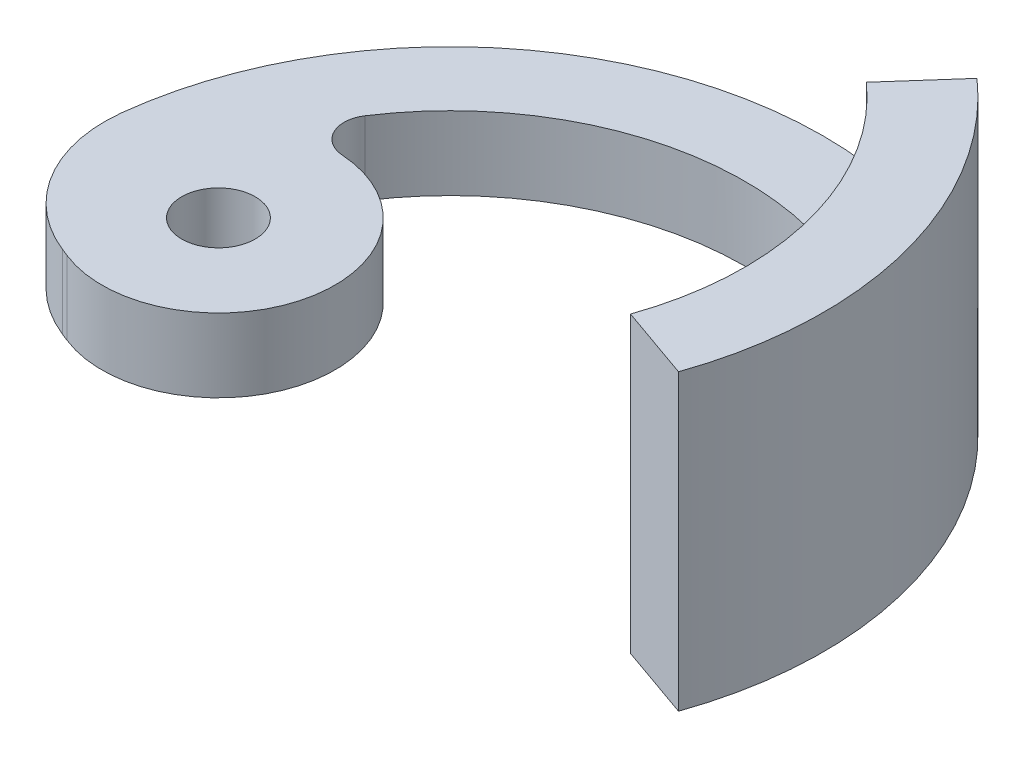
ISO-10303-21;
HEADER;
FILE_DESCRIPTION(('STEP AP214'),'2;1');
FILE_NAME('part.step','',(''),(''),'','','');
FILE_SCHEMA(('AUTOMOTIVE_DESIGN { 1 0 10303 214 1 1 1 1 }'));
ENDSEC;
DATA;
#1=APPLICATION_CONTEXT('core data for automotive mechanical design processes');
#2=APPLICATION_PROTOCOL_DEFINITION('international standard','automotive_design',2000,#1);
#3=PRODUCT_CONTEXT('',#1,'mechanical');
#4=PRODUCT('Part','Part','',(#3));
#5=PRODUCT_RELATED_PRODUCT_CATEGORY('part','',(#4));
#6=PRODUCT_DEFINITION_FORMATION('','',#4);
#7=PRODUCT_DEFINITION_CONTEXT('part definition',#1,'design');
#8=PRODUCT_DEFINITION('design','',#6,#7);
#9=PRODUCT_DEFINITION_SHAPE('','',#8);
#10=(LENGTH_UNIT() NAMED_UNIT(*) SI_UNIT(.MILLI.,.METRE.));
#11=(NAMED_UNIT(*) PLANE_ANGLE_UNIT() SI_UNIT($,.RADIAN.));
#12=(NAMED_UNIT(*) SI_UNIT($,.STERADIAN.) SOLID_ANGLE_UNIT());
#13=UNCERTAINTY_MEASURE_WITH_UNIT(LENGTH_MEASURE(1.E-05),#10,'distance_accuracy_value','');
#14=(GEOMETRIC_REPRESENTATION_CONTEXT(3) GLOBAL_UNCERTAINTY_ASSIGNED_CONTEXT((#13)) GLOBAL_UNIT_ASSIGNED_CONTEXT((#10,
#11,#12)) REPRESENTATION_CONTEXT('',''));
#15=CARTESIAN_POINT('',(0.,0.,0.));
#16=DIRECTION('',(0.,0.,1.));
#17=DIRECTION('',(1.,0.,0.));
#18=AXIS2_PLACEMENT_3D('',#15,#16,#17);
#19=CARTESIAN_POINT('',(0.,5.,0.));
#20=DIRECTION('',(0.,1.,0.));
#21=DIRECTION('',(0.,0.,1.));
#22=AXIS2_PLACEMENT_3D('',#19,#20,#21);
#23=PLANE('',#22);
#24=CARTESIAN_POINT('',(0.,5.,0.));
#25=DIRECTION('',(0.,-1.,0.));
#26=DIRECTION('',(0.,0.,1.));
#27=AXIS2_PLACEMENT_3D('',#24,#25,#26);
#28=CIRCLE('',#27,20.066);
#29=CARTESIAN_POINT('',(-16.780436798581,5.,-11.002785867626));
#30=VERTEX_POINT('',#29);
#31=CARTESIAN_POINT('',(10.0357032359987,5.,-17.3761047579417));
#32=VERTEX_POINT('',#31);
#33=EDGE_CURVE('E151',#30,#32,#28,.T.);
#34=ORIENTED_EDGE('',*,*,#33,.T.);
#35=DIRECTION('',(-0.662716862978516,0.,0.748870055165724));
#36=VECTOR('',#35,1.);
#37=CARTESIAN_POINT('',(13.8375280989914,5.,-21.6721668531235));
#38=LINE('',#37,#36);
#39=CARTESIAN_POINT('',(13.6274879511749,5.,-21.4348214860908));
#40=VERTEX_POINT('',#39);
#41=EDGE_CURVE('E60',#32,#40,#38,.F.);
#42=ORIENTED_EDGE('',*,*,#41,.T.);
#43=CARTESIAN_POINT('',(0.,5.,0.));
#44=DIRECTION('',(0.,1.,0.));
#45=DIRECTION('',(0.,0.,1.));
#46=AXIS2_PLACEMENT_3D('',#43,#44,#45);
#47=CIRCLE('',#46,25.4);
#48=CARTESIAN_POINT('',(-25.2309694679581,5.,-2.92543666945072));
#49=VERTEX_POINT('',#48);
#50=EDGE_CURVE('E153',#40,#49,#47,.T.);
#51=ORIENTED_EDGE('',*,*,#50,.T.);
#52=CARTESIAN_POINT('',(-15.643201070134,5.,-1.81377073505945));
#53=DIRECTION('',(0.,1.,0.));
#54=DIRECTION('',(0.,0.,1.));
#55=AXIS2_PLACEMENT_3D('',#52,#53,#54);
#56=CIRCLE('',#55,9.652);
#57=CARTESIAN_POINT('',(-19.1926366470544,5.,7.16189698858608));
#58=VERTEX_POINT('',#57);
#59=EDGE_CURVE('E186',#49,#58,#56,.T.);
#60=ORIENTED_EDGE('',*,*,#59,.T.);
#61=DIRECTION('',(0.929928276382669,0.,0.367740942490713));
#62=VECTOR('',#61,1.);
#63=CARTESIAN_POINT('',(-18.6630031843254,5.,7.37134100024276));
#64=LINE('',#63,#62);
#65=CARTESIAN_POINT('',(-18.6630031843254,5.,7.37134100024276));
#66=VERTEX_POINT('',#65);
#67=EDGE_CURVE('E156',#58,#66,#64,.T.);
#68=ORIENTED_EDGE('',*,*,#67,.T.);
#69=CARTESIAN_POINT('',(-15.748,5.,0.));
#70=DIRECTION('',(0.,1.,0.));
#71=DIRECTION('',(0.,0.,1.));
#72=AXIS2_PLACEMENT_3D('',#69,#70,#71);
#73=CIRCLE('',#72,7.92678444935191);
#74=CARTESIAN_POINT('',(-15.2368741595253,5.,-7.91028836906002));
#75=VERTEX_POINT('',#74);
#76=EDGE_CURVE('E158',#66,#75,#73,.T.);
#77=ORIENTED_EDGE('',*,*,#76,.T.);
#78=CARTESIAN_POINT('',(-15.1079124490762,5.,-9.90612625757653));
#79=DIRECTION('',(0.,1.,0.));
#80=DIRECTION('',(0.,0.,1.));
#81=AXIS2_PLACEMENT_3D('',#78,#79,#80);
#82=CIRCLE('',#81,2.);
#83=EDGE_CURVE('E195',#75,#30,#82,.F.);
#84=ORIENTED_EDGE('',*,*,#83,.T.);
#85=EDGE_LOOP('',(#34,#42,#51,#60,#68,#77,#84));
#86=FACE_BOUND('',#85,.T.);
#87=CARTESIAN_POINT('',(-15.748,5.,0.));
#88=DIRECTION('',(0.,1.,0.));
#89=DIRECTION('',(0.,0.,1.));
#90=AXIS2_PLACEMENT_3D('',#87,#88,#89);
#91=CIRCLE('',#90,2.5);
#92=CARTESIAN_POINT('',(-15.748,5.,2.5));
#93=VERTEX_POINT('',#92);
#94=EDGE_CURVE('E145',#93,#93,#91,.T.);
#95=ORIENTED_EDGE('',*,*,#94,.F.);
#96=EDGE_LOOP('',(#95));
#97=FACE_BOUND('',#96,.T.);
#98=ADVANCED_FACE('F33',(#86,#97),#23,.T.);
#99=CARTESIAN_POINT('',(0.,0.,0.));
#100=DIRECTION('',(0.,1.,0.));
#101=DIRECTION('',(0.,0.,1.));
#102=AXIS2_PLACEMENT_3D('',#99,#100,#101);
#103=PLANE('',#102);
#104=DIRECTION('',(0.929928276382669,0.,0.367740942490713));
#105=VECTOR('',#104,1.);
#106=CARTESIAN_POINT('',(-18.6630031843254,0.,7.37134100024276));
#107=LINE('',#106,#105);
#108=CARTESIAN_POINT('',(-19.1926366470544,0.,7.16189698858608));
#109=VERTEX_POINT('',#108);
#110=CARTESIAN_POINT('',(-18.6630031843254,0.,7.37134100024276));
#111=VERTEX_POINT('',#110);
#112=EDGE_CURVE('E168',#109,#111,#107,.T.);
#113=ORIENTED_EDGE('',*,*,#112,.F.);
#114=CARTESIAN_POINT('',(-15.643201070134,0.,-1.81377073505945));
#115=DIRECTION('',(0.,1.,0.));
#116=DIRECTION('',(0.,0.,1.));
#117=AXIS2_PLACEMENT_3D('',#114,#115,#116);
#118=CIRCLE('',#117,9.652);
#119=CARTESIAN_POINT('',(-25.2309694679581,0.,-2.92543666945072));
#120=VERTEX_POINT('',#119);
#121=EDGE_CURVE('E181',#109,#120,#118,.F.);
#122=ORIENTED_EDGE('',*,*,#121,.T.);
#123=CARTESIAN_POINT('',(0.,0.,0.));
#124=DIRECTION('',(0.,1.,0.));
#125=DIRECTION('',(0.,0.,1.));
#126=AXIS2_PLACEMENT_3D('',#123,#124,#125);
#127=CIRCLE('',#126,25.4);
#128=CARTESIAN_POINT('',(23.9653004716015,0.,8.4157217935159));
#129=VERTEX_POINT('',#128);
#130=EDGE_CURVE('E165',#129,#120,#127,.T.);
#131=ORIENTED_EDGE('',*,*,#130,.F.);
#132=DIRECTION('',(0.943515766598483,0.,0.33132762966598));
#133=VECTOR('',#132,1.);
#134=CARTESIAN_POINT('',(18.9325873725652,0.,6.64842021687756));
#135=LINE('',#134,#133);
#136=CARTESIAN_POINT('',(18.9325873725652,0.,6.64842021687756));
#137=VERTEX_POINT('',#136);
#138=EDGE_CURVE('E163',#137,#129,#135,.T.);
#139=ORIENTED_EDGE('',*,*,#138,.F.);
#140=CARTESIAN_POINT('',(0.,0.,0.));
#141=DIRECTION('',(0.,-1.,0.));
#142=DIRECTION('',(0.,0.,1.));
#143=AXIS2_PLACEMENT_3D('',#140,#141,#142);
#144=CIRCLE('',#143,20.066);
#145=CARTESIAN_POINT('',(-16.780436798581,0.,-11.002785867626));
#146=VERTEX_POINT('',#145);
#147=EDGE_CURVE('E148',#146,#137,#144,.T.);
#148=ORIENTED_EDGE('',*,*,#147,.F.);
#149=CARTESIAN_POINT('',(-15.1079124490762,0.,-9.90612625757653));
#150=DIRECTION('',(0.,1.,0.));
#151=DIRECTION('',(0.,0.,1.));
#152=AXIS2_PLACEMENT_3D('',#149,#150,#151);
#153=CIRCLE('',#152,2.);
#154=CARTESIAN_POINT('',(-15.2368741595253,0.,-7.91028836906002));
#155=VERTEX_POINT('',#154);
#156=EDGE_CURVE('E193',#146,#155,#153,.T.);
#157=ORIENTED_EDGE('',*,*,#156,.T.);
#158=CARTESIAN_POINT('',(-15.748,0.,0.));
#159=DIRECTION('',(0.,1.,0.));
#160=DIRECTION('',(0.,0.,1.));
#161=AXIS2_PLACEMENT_3D('',#158,#159,#160);
#162=CIRCLE('',#161,7.92678444935191);
#163=EDGE_CURVE('E154',#111,#155,#162,.T.);
#164=ORIENTED_EDGE('',*,*,#163,.F.);
#165=EDGE_LOOP('',(#113,#122,#131,#139,#148,#157,#164));
#166=FACE_BOUND('',#165,.T.);
#167=CARTESIAN_POINT('',(-15.748,0.,0.));
#168=DIRECTION('',(0.,1.,0.));
#169=DIRECTION('',(0.,0.,1.));
#170=AXIS2_PLACEMENT_3D('',#167,#168,#169);
#171=CIRCLE('',#170,2.5);
#172=CARTESIAN_POINT('',(-15.748,0.,2.5));
#173=VERTEX_POINT('',#172);
#174=EDGE_CURVE('E143',#173,#173,#171,.T.);
#175=ORIENTED_EDGE('',*,*,#174,.T.);
#176=EDGE_LOOP('',(#175));
#177=FACE_BOUND('',#176,.T.);
#178=ADVANCED_FACE('F208',(#166,#177),#103,.F.);
#179=CARTESIAN_POINT('',(0.,5.,0.));
#180=DIRECTION('',(0.,-1.,0.));
#181=DIRECTION('',(0.,0.,-1.));
#182=AXIS2_PLACEMENT_3D('',#179,#180,#181);
#183=CYLINDRICAL_SURFACE('',#182,20.066);
#184=ORIENTED_EDGE('',*,*,#33,.F.);
#185=DIRECTION('',(0.,-1.,0.));
#186=VECTOR('',#185,1.);
#187=CARTESIAN_POINT('',(-16.780436798581,5.,-11.002785867626));
#188=LINE('',#187,#186);
#189=EDGE_CURVE('E188',#30,#146,#188,.T.);
#190=ORIENTED_EDGE('',*,*,#189,.T.);
#191=ORIENTED_EDGE('',*,*,#147,.T.);
#192=DIRECTION('',(0.,-1.,0.));
#193=VECTOR('',#192,1.);
#194=CARTESIAN_POINT('',(18.9325873725652,5.,6.64842021687756));
#195=LINE('',#194,#193);
#196=CARTESIAN_POINT('',(18.9325873725652,20.,6.64842021687756));
#197=VERTEX_POINT('',#196);
#198=EDGE_CURVE('E138',#197,#137,#195,.T.);
#199=ORIENTED_EDGE('',*,*,#198,.F.);
#200=CARTESIAN_POINT('',(0.,20.,0.));
#201=DIRECTION('',(0.,1.,0.));
#202=DIRECTION('',(0.,0.,-1.));
#203=AXIS2_PLACEMENT_3D('',#200,#201,#202);
#204=CIRCLE('',#203,20.066);
#205=CARTESIAN_POINT('',(13.2980765725269,20.,-15.0268265269554));
#206=VERTEX_POINT('',#205);
#207=EDGE_CURVE('E131',#197,#206,#204,.T.);
#208=ORIENTED_EDGE('',*,*,#207,.T.);
#209=DIRECTION('',(0.,-1.,0.));
#210=VECTOR('',#209,1.);
#211=CARTESIAN_POINT('',(13.2980765725269,20.,-15.0268265269554));
#212=LINE('',#211,#210);
#213=CARTESIAN_POINT('',(13.2980765725269,9.,-15.0268265269554));
#214=VERTEX_POINT('',#213);
#215=EDGE_CURVE('E115',#206,#214,#212,.T.);
#216=ORIENTED_EDGE('',*,*,#215,.T.);
#217=CARTESIAN_POINT('',(13.2980765725269,9.,-15.0268265269554));
#218=CARTESIAN_POINT('',(13.2980799650412,8.88753775298471,-15.0268141274205));
#219=CARTESIAN_POINT('',(13.2945246557272,8.77508061834731,-15.0299695709891));
#220=CARTESIAN_POINT('',(13.2803250560475,8.55097014897028,-15.042522623992));
#221=CARTESIAN_POINT('',(13.2696810938581,8.43931677726151,-15.0519199444523));
#222=CARTESIAN_POINT('',(13.2413423370098,8.21767295793381,-15.0768546850063));
#223=CARTESIAN_POINT('',(13.223652387894,8.10768142130988,-15.0923878853794));
#224=CARTESIAN_POINT('',(13.1812980941764,7.89009871021996,-15.12939257249));
#225=CARTESIAN_POINT('',(13.1566338349241,7.78250750639684,-15.1508639865574));
#226=CARTESIAN_POINT('',(13.0722511909287,7.46436758652372,-15.2238704080345));
#227=CARTESIAN_POINT('',(13.0021320983301,7.25836727563912,-15.2840073771449));
#228=CARTESIAN_POINT('',(12.835330514823,6.8649621050413,-15.4243457168031));
#229=CARTESIAN_POINT('',(12.7386525491429,6.67755408488174,-15.5045436690562));
#230=CARTESIAN_POINT('',(12.5204996533811,6.32680145437843,-15.6812328041605));
#231=CARTESIAN_POINT('',(12.3990663400348,6.16341724035032,-15.7776965957281));
#232=CARTESIAN_POINT('',(12.1336089246621,5.86505193687456,-15.9827389861971));
#233=CARTESIAN_POINT('',(11.9895841469595,5.73007169722941,-16.0913179474167));
#234=CARTESIAN_POINT('',(11.6831325218311,5.49312817039595,-16.3151615229398));
#235=CARTESIAN_POINT('',(11.5208365914509,5.39094795273707,-16.4303760054858));
#236=CARTESIAN_POINT('',(11.1809175621154,5.22104176034368,-16.6635476423324));
#237=CARTESIAN_POINT('',(11.0032992811561,5.15330500098255,-16.7815039260331));
#238=CARTESIAN_POINT('',(10.6935428384105,5.06896931617142,-16.9798476598907));
#239=CARTESIAN_POINT('',(10.5641327221943,5.04306274995365,-17.0606788268287));
#240=CARTESIAN_POINT('',(10.3020308333363,5.00857724952146,-17.2202290040084));
#241=CARTESIAN_POINT('',(10.1693445602822,4.99997104199296,-17.2989511453992));
#242=CARTESIAN_POINT('',(10.0357032359987,5.,-17.3761047579417));
#243=B_SPLINE_CURVE_WITH_KNOTS('',3,(#217,#218,#219,#220,#221,#222,#223,#224,#225,#226,#227,
#228,#229,#230,#231,#232,#233,#234,#235,#236,#237,#238,#239,#240,#241,#242),.UNSPECIFIED.,.F.,
.F.,(4,2,2,2,2,2,2,2,2,2,2,2,4),(0.,0.337277087458648,0.6745385614239,1.0115684991667,
1.34859431262253,2.02238962651783,2.69607020705853,3.36862745262201,4.04120481718692,
4.70923762561278,5.37706113660133,5.84038817175952,6.30298421601356),.UNSPECIFIED.);
#244=EDGE_CURVE('E47',#214,#32,#243,.T.);
#245=ORIENTED_EDGE('',*,*,#244,.T.);
#246=EDGE_LOOP('',(#184,#190,#191,#199,#208,#216,#245));
#247=FACE_BOUND('',#246,.T.);
#248=ADVANCED_FACE('F136',(#247),#183,.F.);
#249=CARTESIAN_POINT('',(18.9325873725652,5.,6.64842021687756));
#250=DIRECTION('',(0.33132762966598,0.,-0.943515766598483));
#251=DIRECTION('',(-0.943515766598483,0.,-0.33132762966598));
#252=AXIS2_PLACEMENT_3D('',#249,#250,#251);
#253=PLANE('',#252);
#254=ORIENTED_EDGE('',*,*,#138,.T.);
#255=DIRECTION('',(0.,-1.,0.));
#256=VECTOR('',#255,1.);
#257=CARTESIAN_POINT('',(23.9653004716015,5.,8.4157217935159));
#258=LINE('',#257,#256);
#259=CARTESIAN_POINT('',(23.9653004716015,20.,8.4157217935159));
#260=VERTEX_POINT('',#259);
#261=EDGE_CURVE('E174',#260,#129,#258,.T.);
#262=ORIENTED_EDGE('',*,*,#261,.F.);
#263=DIRECTION('',(-0.943515766598483,0.,-0.33132762966598));
#264=VECTOR('',#263,1.);
#265=CARTESIAN_POINT('',(18.9325873725652,20.,6.64842021687756));
#266=LINE('',#265,#264);
#267=EDGE_CURVE('E124',#260,#197,#266,.T.);
#268=ORIENTED_EDGE('',*,*,#267,.T.);
#269=ORIENTED_EDGE('',*,*,#198,.T.);
#270=EDGE_LOOP('',(#254,#262,#268,#269));
#271=FACE_BOUND('',#270,.T.);
#272=ADVANCED_FACE('F207',(#271),#253,.F.);
#273=CARTESIAN_POINT('',(0.,5.,0.));
#274=DIRECTION('',(0.,-1.,0.));
#275=DIRECTION('',(0.,0.,-1.));
#276=AXIS2_PLACEMENT_3D('',#273,#274,#275);
#277=CYLINDRICAL_SURFACE('',#276,25.4);
#278=ORIENTED_EDGE('',*,*,#130,.T.);
#279=DIRECTION('',(0.,-1.,0.));
#280=VECTOR('',#279,1.);
#281=CARTESIAN_POINT('',(-25.2309694679581,5.,-2.92543666945072));
#282=LINE('',#281,#280);
#283=EDGE_CURVE('E183',#120,#49,#282,.F.);
#284=ORIENTED_EDGE('',*,*,#283,.T.);
#285=ORIENTED_EDGE('',*,*,#50,.F.);
#286=CARTESIAN_POINT('',(13.6274879511749,5.,-21.4348214860908));
#287=CARTESIAN_POINT('',(13.7223204718669,4.99998758855317,-21.3745390831315));
#288=CARTESIAN_POINT('',(13.8167476471439,5.0046172617631,-21.3136136349515));
#289=CARTESIAN_POINT('',(14.0041550507292,5.02313265820354,-21.1909434509581));
#290=CARTESIAN_POINT('',(14.0971352327566,5.03701867687026,-21.1291986890561));
#291=CARTESIAN_POINT('',(14.280953375509,5.0740080006313,-21.0053962053335));
#292=CARTESIAN_POINT('',(14.371792537708,5.09710599920656,-20.9433386839618));
#293=CARTESIAN_POINT('',(14.5507701244615,5.15239860651169,-20.8193883468929));
#294=CARTESIAN_POINT('',(14.6389086506761,5.18459287236334,-20.7574955250763));
#295=CARTESIAN_POINT('',(14.8119689527299,5.25791550725873,-20.6343612634176));
#296=CARTESIAN_POINT('',(14.896888388743,5.29905023387703,-20.5731203198019));
#297=CARTESIAN_POINT('',(15.0629290846722,5.38999237136869,-20.4518639819873));
#298=CARTESIAN_POINT('',(15.1440489226886,5.43980299658167,-20.3918490512545));
#299=CARTESIAN_POINT('',(15.3018984440993,5.54771343354885,-20.2736681462522));
#300=CARTESIAN_POINT('',(15.3786310425693,5.6058076495011,-20.2155009559561));
#301=CARTESIAN_POINT('',(15.5273332071651,5.72992948394623,-20.101510017046));
#302=CARTESIAN_POINT('',(15.5993010081075,5.79596001733186,-20.0456871396839));
#303=CARTESIAN_POINT('',(15.7375548295703,5.93499374212438,-19.9373275858509));
#304=CARTESIAN_POINT('',(15.8038763136343,6.00794620622194,-19.8847710610759));
#305=CARTESIAN_POINT('',(15.9310464011969,6.16071216754944,-19.7830330158645));
#306=CARTESIAN_POINT('',(15.9918929698859,6.24052819431676,-19.7338527518472));
#307=CARTESIAN_POINT('',(16.1077657725174,6.40643308161034,-19.6393857310253));
#308=CARTESIAN_POINT('',(16.1627927284056,6.49252116182071,-19.5940984914065));
#309=CARTESIAN_POINT('',(16.2667698895986,6.67036856443594,-19.5078639709005));
#310=CARTESIAN_POINT('',(16.3157179119929,6.76212990646176,-19.4669182497952));
#311=CARTESIAN_POINT('',(16.4532952178881,7.0454503761403,-19.351060162527));
#312=CARTESIAN_POINT('',(16.5324410000405,7.24473393606441,-19.2833053106676));
#313=CARTESIAN_POINT('',(16.6637500962809,7.65777628586804,-19.1699506846049));
#314=CARTESIAN_POINT('',(16.7159275731852,7.87152741104209,-19.1243392821975));
#315=CARTESIAN_POINT('',(16.7804404040492,8.23866148380992,-19.0677225270842));
#316=CARTESIAN_POINT('',(16.8001506481193,8.38983030483996,-19.0503404333911));
#317=CARTESIAN_POINT('',(16.8264305897587,8.69398122563975,-19.0271205487026));
#318=CARTESIAN_POINT('',(16.8330175130046,8.84696068293086,-19.0212676246283));
#319=CARTESIAN_POINT('',(16.8330083196543,9.,-19.0212994012094));
#320=B_SPLINE_CURVE_WITH_KNOTS('',3,(#286,#287,#288,#289,#290,#291,#292,#293,#294,#295,#296,
#297,#298,#299,#300,#301,#302,#303,#304,#305,#306,#307,#308,#309,#310,#311,#312,#313,#314,#315,
#316,#317,#318,#319),.UNSPECIFIED.,.F.,.F.,(4,2,2,2,2,2,2,2,2,2,2,2,2,2,2,2,4),(0.,
0.33701857116922,0.674047899527767,1.01088336344667,1.34770613225294,1.68476920445466,
2.02195742204973,2.35891892911874,2.69600457757779,3.03078691214741,3.36569316252457,
3.7005578176122,4.03554237511777,4.70675479458268,5.37761435754236,5.83696687045776,
6.29571603877999),.UNSPECIFIED.);
#321=CARTESIAN_POINT('',(16.8330083196543,9.,-19.0212994012094));
#322=VERTEX_POINT('',#321);
#323=EDGE_CURVE('E11',#40,#322,#320,.T.);
#324=ORIENTED_EDGE('',*,*,#323,.T.);
#325=DIRECTION('',(0.,-1.,0.));
#326=VECTOR('',#325,1.);
#327=CARTESIAN_POINT('',(16.8330083196543,20.,-19.0212994012094));
#328=LINE('',#327,#326);
#329=CARTESIAN_POINT('',(16.8330083196543,20.,-19.0212994012094));
#330=VERTEX_POINT('',#329);
#331=EDGE_CURVE('E123',#330,#322,#328,.T.);
#332=ORIENTED_EDGE('',*,*,#331,.F.);
#333=CARTESIAN_POINT('',(0.,20.,0.));
#334=DIRECTION('',(0.,-1.,0.));
#335=DIRECTION('',(0.,0.,-1.));
#336=AXIS2_PLACEMENT_3D('',#333,#334,#335);
#337=CIRCLE('',#336,25.4);
#338=EDGE_CURVE('E134',#330,#260,#337,.T.);
#339=ORIENTED_EDGE('',*,*,#338,.T.);
#340=ORIENTED_EDGE('',*,*,#261,.T.);
#341=EDGE_LOOP('',(#278,#284,#285,#324,#332,#339,#340));
#342=FACE_BOUND('',#341,.T.);
#343=ADVANCED_FACE('F238',(#342),#277,.T.);
#344=CARTESIAN_POINT('',(-18.6630031843254,5.,7.37134100024276));
#345=DIRECTION('',(0.367740942490713,0.,-0.929928276382669));
#346=DIRECTION('',(-0.929928276382669,0.,-0.367740942490713));
#347=AXIS2_PLACEMENT_3D('',#344,#345,#346);
#348=PLANE('',#347);
#349=ORIENTED_EDGE('',*,*,#67,.F.);
#350=DIRECTION('',(0.,-1.,0.));
#351=VECTOR('',#350,1.);
#352=CARTESIAN_POINT('',(-19.1926366470544,5.,7.16189698858608));
#353=LINE('',#352,#351);
#354=EDGE_CURVE('E178',#58,#109,#353,.T.);
#355=ORIENTED_EDGE('',*,*,#354,.T.);
#356=ORIENTED_EDGE('',*,*,#112,.T.);
#357=DIRECTION('',(0.,-1.,0.));
#358=VECTOR('',#357,1.);
#359=CARTESIAN_POINT('',(-18.6630031843254,5.,7.37134100024276));
#360=LINE('',#359,#358);
#361=EDGE_CURVE('E161',#66,#111,#360,.T.);
#362=ORIENTED_EDGE('',*,*,#361,.F.);
#363=EDGE_LOOP('',(#349,#355,#356,#362));
#364=FACE_BOUND('',#363,.T.);
#365=ADVANCED_FACE('F235',(#364),#348,.F.);
#366=CARTESIAN_POINT('',(-15.748,5.,0.));
#367=DIRECTION('',(0.,-1.,0.));
#368=DIRECTION('',(0.,0.,-1.));
#369=AXIS2_PLACEMENT_3D('',#366,#367,#368);
#370=CYLINDRICAL_SURFACE('',#369,7.92678444935191);
#371=ORIENTED_EDGE('',*,*,#163,.T.);
#372=DIRECTION('',(0.,-1.,0.));
#373=VECTOR('',#372,1.);
#374=CARTESIAN_POINT('',(-15.2368741595253,5.,-7.91028836906002));
#375=LINE('',#374,#373);
#376=EDGE_CURVE('E191',#155,#75,#375,.F.);
#377=ORIENTED_EDGE('',*,*,#376,.T.);
#378=ORIENTED_EDGE('',*,*,#76,.F.);
#379=ORIENTED_EDGE('',*,*,#361,.T.);
#380=EDGE_LOOP('',(#371,#377,#378,#379));
#381=FACE_BOUND('',#380,.T.);
#382=ADVANCED_FACE('F232',(#381),#370,.T.);
#383=CARTESIAN_POINT('',(-15.748,5.,0.));
#384=DIRECTION('',(0.,-1.,0.));
#385=DIRECTION('',(0.,0.,-1.));
#386=AXIS2_PLACEMENT_3D('',#383,#384,#385);
#387=CYLINDRICAL_SURFACE('',#386,2.5);
#388=ORIENTED_EDGE('',*,*,#94,.T.);
#389=EDGE_LOOP('',(#388));
#390=FACE_BOUND('',#389,.T.);
#391=ORIENTED_EDGE('',*,*,#174,.F.);
#392=EDGE_LOOP('',(#391));
#393=FACE_BOUND('',#392,.T.);
#394=ADVANCED_FACE('F229',(#390,#393),#387,.F.);
#395=CARTESIAN_POINT('',(13.2980765725269,20.,-15.0268265269554));
#396=DIRECTION('',(-0.748870055165724,0.,-0.662716862978516));
#397=DIRECTION('',(-0.662716862978516,0.,0.748870055165724));
#398=AXIS2_PLACEMENT_3D('',#395,#396,#397);
#399=PLANE('',#398);
#400=ORIENTED_EDGE('',*,*,#331,.T.);
#401=DIRECTION('',(-0.662716862978516,0.,0.748870055165724));
#402=VECTOR('',#401,1.);
#403=CARTESIAN_POINT('',(13.2980765725269,9.,-15.0268265269554));
#404=LINE('',#403,#402);
#405=EDGE_CURVE('E121',#322,#214,#404,.T.);
#406=ORIENTED_EDGE('',*,*,#405,.T.);
#407=ORIENTED_EDGE('',*,*,#215,.F.);
#408=DIRECTION('',(0.662716862978516,0.,-0.748870055165724));
#409=VECTOR('',#408,1.);
#410=CARTESIAN_POINT('',(13.2980765725269,20.,-15.0268265269554));
#411=LINE('',#410,#409);
#412=EDGE_CURVE('E119',#206,#330,#411,.T.);
#413=ORIENTED_EDGE('',*,*,#412,.T.);
#414=EDGE_LOOP('',(#400,#406,#407,#413));
#415=FACE_BOUND('',#414,.T.);
#416=ADVANCED_FACE('F118',(#415),#399,.T.);
#417=CARTESIAN_POINT('',(0.,20.,0.));
#418=DIRECTION('',(0.,-1.,0.));
#419=DIRECTION('',(0.,0.,-1.));
#420=AXIS2_PLACEMENT_3D('',#417,#418,#419);
#421=PLANE('',#420);
#422=ORIENTED_EDGE('',*,*,#207,.F.);
#423=ORIENTED_EDGE('',*,*,#267,.F.);
#424=ORIENTED_EDGE('',*,*,#338,.F.);
#425=ORIENTED_EDGE('',*,*,#412,.F.);
#426=EDGE_LOOP('',(#422,#423,#424,#425));
#427=FACE_BOUND('',#426,.T.);
#428=ADVANCED_FACE('F129',(#427),#421,.F.);
#429=CARTESIAN_POINT('',(-15.643201070134,5.,-1.81377073505945));
#430=DIRECTION('',(0.,-1.,0.));
#431=DIRECTION('',(0.,0.,-1.));
#432=AXIS2_PLACEMENT_3D('',#429,#430,#431);
#433=CYLINDRICAL_SURFACE('',#432,9.652);
#434=ORIENTED_EDGE('',*,*,#59,.F.);
#435=ORIENTED_EDGE('',*,*,#283,.F.);
#436=ORIENTED_EDGE('',*,*,#121,.F.);
#437=ORIENTED_EDGE('',*,*,#354,.F.);
#438=EDGE_LOOP('',(#434,#435,#436,#437));
#439=FACE_BOUND('',#438,.T.);
#440=ADVANCED_FACE('F209',(#439),#433,.T.);
#441=CARTESIAN_POINT('',(-15.1079124490762,5.,-9.90612625757653));
#442=DIRECTION('',(0.,-1.,0.));
#443=DIRECTION('',(0.,0.,-1.));
#444=AXIS2_PLACEMENT_3D('',#441,#442,#443);
#445=CYLINDRICAL_SURFACE('',#444,2.);
#446=ORIENTED_EDGE('',*,*,#83,.F.);
#447=ORIENTED_EDGE('',*,*,#376,.F.);
#448=ORIENTED_EDGE('',*,*,#156,.F.);
#449=ORIENTED_EDGE('',*,*,#189,.F.);
#450=EDGE_LOOP('',(#446,#447,#448,#449));
#451=FACE_BOUND('',#450,.T.);
#452=ADVANCED_FACE('F211',(#451),#445,.F.);
#453=CARTESIAN_POINT('',(10.302596351864,9.,-17.6776939788695));
#454=DIRECTION('',(0.662716862978516,0.,-0.748870055165724));
#455=DIRECTION('',(-0.748870055165724,0.,-0.662716862978516));
#456=AXIS2_PLACEMENT_3D('',#453,#454,#455);
#457=CYLINDRICAL_SURFACE('',#456,4.);
#458=ORIENTED_EDGE('',*,*,#323,.F.);
#459=ORIENTED_EDGE('',*,*,#41,.F.);
#460=ORIENTED_EDGE('',*,*,#244,.F.);
#461=ORIENTED_EDGE('',*,*,#405,.F.);
#462=EDGE_LOOP('',(#458,#459,#460,#461));
#463=FACE_BOUND('',#462,.T.);
#464=ADVANCED_FACE('F35',(#463),#457,.F.);
#465=CLOSED_SHELL('',(#98,#178,#248,#272,#343,#365,#382,#394,#416,#428,#440,#452,#464));
#466=MANIFOLD_SOLID_BREP('B2',#465);
#467=ADVANCED_BREP_SHAPE_REPRESENTATION('',(#18,#466),#14);
#468=SHAPE_DEFINITION_REPRESENTATION(#9,#467);
ENDSEC;
END-ISO-10303-21;
